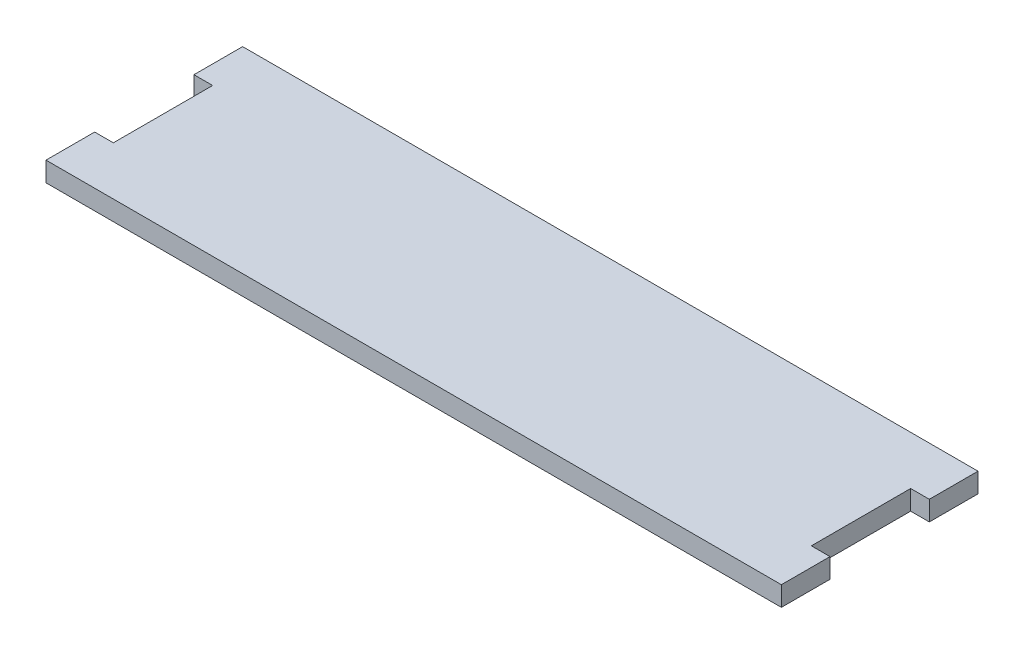
ISO-10303-21;
HEADER;
FILE_DESCRIPTION(('STEP AP214'),'2;1');
FILE_NAME('part.step','',(''),(''),'','','');
FILE_SCHEMA(('AUTOMOTIVE_DESIGN { 1 0 10303 214 1 1 1 1 }'));
ENDSEC;
DATA;
#1=APPLICATION_CONTEXT('core data for automotive mechanical design processes');
#2=APPLICATION_PROTOCOL_DEFINITION('international standard','automotive_design',2000,#1);
#3=PRODUCT_CONTEXT('',#1,'mechanical');
#4=PRODUCT('Part','Part','',(#3));
#5=PRODUCT_RELATED_PRODUCT_CATEGORY('part','',(#4));
#6=PRODUCT_DEFINITION_FORMATION('','',#4);
#7=PRODUCT_DEFINITION_CONTEXT('part definition',#1,'design');
#8=PRODUCT_DEFINITION('design','',#6,#7);
#9=PRODUCT_DEFINITION_SHAPE('','',#8);
#10=(LENGTH_UNIT() NAMED_UNIT(*) SI_UNIT(.MILLI.,.METRE.));
#11=(NAMED_UNIT(*) PLANE_ANGLE_UNIT() SI_UNIT($,.RADIAN.));
#12=(NAMED_UNIT(*) SI_UNIT($,.STERADIAN.) SOLID_ANGLE_UNIT());
#13=UNCERTAINTY_MEASURE_WITH_UNIT(LENGTH_MEASURE(1.E-05),#10,'distance_accuracy_value','');
#14=(GEOMETRIC_REPRESENTATION_CONTEXT(3) GLOBAL_UNCERTAINTY_ASSIGNED_CONTEXT((#13)) GLOBAL_UNIT_ASSIGNED_CONTEXT((#10,
#11,#12)) REPRESENTATION_CONTEXT('',''));
#15=CARTESIAN_POINT('',(0.,0.,0.));
#16=DIRECTION('',(0.,0.,1.));
#17=DIRECTION('',(1.,0.,0.));
#18=AXIS2_PLACEMENT_3D('',#15,#16,#17);
#19=CARTESIAN_POINT('',(-90.17,5.08,-25.4));
#20=DIRECTION('',(0.,0.,1.));
#21=DIRECTION('',(1.,0.,0.));
#22=AXIS2_PLACEMENT_3D('',#19,#20,#21);
#23=PLANE('',#22);
#24=DIRECTION('',(-1.,0.,0.));
#25=VECTOR('',#24,1.);
#26=CARTESIAN_POINT('',(-90.17,0.,-25.4));
#27=LINE('',#26,#25);
#28=CARTESIAN_POINT('',(94.996,0.,-25.4));
#29=VERTEX_POINT('',#28);
#30=CARTESIAN_POINT('',(-94.996,0.,-25.4));
#31=VERTEX_POINT('',#30);
#32=EDGE_CURVE('E97',#29,#31,#27,.T.);
#33=ORIENTED_EDGE('',*,*,#32,.T.);
#34=DIRECTION('',(0.,-1.,0.));
#35=VECTOR('',#34,1.);
#36=CARTESIAN_POINT('',(-94.996,5.08,-25.4));
#37=LINE('',#36,#35);
#38=CARTESIAN_POINT('',(-94.996,5.08,-25.4));
#39=VERTEX_POINT('',#38);
#40=EDGE_CURVE('E11',#39,#31,#37,.T.);
#41=ORIENTED_EDGE('',*,*,#40,.F.);
#42=DIRECTION('',(-1.,0.,0.));
#43=VECTOR('',#42,1.);
#44=CARTESIAN_POINT('',(90.17,5.08,-25.4));
#45=LINE('',#44,#43);
#46=CARTESIAN_POINT('',(94.996,5.08,-25.4));
#47=VERTEX_POINT('',#46);
#48=EDGE_CURVE('E103',#47,#39,#45,.T.);
#49=ORIENTED_EDGE('',*,*,#48,.F.);
#50=DIRECTION('',(0.,-1.,0.));
#51=VECTOR('',#50,1.);
#52=CARTESIAN_POINT('',(94.996,5.08,-25.4));
#53=LINE('',#52,#51);
#54=EDGE_CURVE('E149',#47,#29,#53,.T.);
#55=ORIENTED_EDGE('',*,*,#54,.T.);
#56=EDGE_LOOP('',(#33,#41,#49,#55));
#57=FACE_BOUND('',#56,.T.);
#58=ADVANCED_FACE('F33',(#57),#23,.F.);
#59=CARTESIAN_POINT('',(-94.996,5.08,-25.4));
#60=DIRECTION('',(1.,0.,0.));
#61=DIRECTION('',(0.,0.,-1.));
#62=AXIS2_PLACEMENT_3D('',#59,#60,#61);
#63=PLANE('',#62);
#64=DIRECTION('',(0.,0.,1.));
#65=VECTOR('',#64,1.);
#66=CARTESIAN_POINT('',(-94.996,0.,-25.4));
#67=LINE('',#66,#65);
#68=CARTESIAN_POINT('',(-94.996,0.,-12.827));
#69=VERTEX_POINT('',#68);
#70=EDGE_CURVE('E154',#31,#69,#67,.T.);
#71=ORIENTED_EDGE('',*,*,#70,.T.);
#72=DIRECTION('',(0.,-1.,0.));
#73=VECTOR('',#72,1.);
#74=CARTESIAN_POINT('',(-94.996,5.08,-12.827));
#75=LINE('',#74,#73);
#76=CARTESIAN_POINT('',(-94.996,5.08,-12.827));
#77=VERTEX_POINT('',#76);
#78=EDGE_CURVE('E41',#77,#69,#75,.T.);
#79=ORIENTED_EDGE('',*,*,#78,.F.);
#80=DIRECTION('',(0.,0.,1.));
#81=VECTOR('',#80,1.);
#82=CARTESIAN_POINT('',(-94.996,5.08,-25.4));
#83=LINE('',#82,#81);
#84=EDGE_CURVE('E243',#39,#77,#83,.T.);
#85=ORIENTED_EDGE('',*,*,#84,.F.);
#86=ORIENTED_EDGE('',*,*,#40,.T.);
#87=EDGE_LOOP('',(#71,#79,#85,#86));
#88=FACE_BOUND('',#87,.T.);
#89=ADVANCED_FACE('F246',(#88),#63,.F.);
#90=CARTESIAN_POINT('',(-90.17,5.08,-12.827));
#91=DIRECTION('',(0.,0.,-1.));
#92=DIRECTION('',(-1.,0.,0.));
#93=AXIS2_PLACEMENT_3D('',#90,#91,#92);
#94=PLANE('',#93);
#95=DIRECTION('',(1.,0.,0.));
#96=VECTOR('',#95,1.);
#97=CARTESIAN_POINT('',(-90.17,0.,-12.827));
#98=LINE('',#97,#96);
#99=CARTESIAN_POINT('',(-90.17,0.,-12.827));
#100=VERTEX_POINT('',#99);
#101=EDGE_CURVE('E156',#69,#100,#98,.T.);
#102=ORIENTED_EDGE('',*,*,#101,.T.);
#103=DIRECTION('',(0.,-1.,0.));
#104=VECTOR('',#103,1.);
#105=CARTESIAN_POINT('',(-90.17,5.08,-12.827));
#106=LINE('',#105,#104);
#107=CARTESIAN_POINT('',(-90.17,5.08,-12.827));
#108=VERTEX_POINT('',#107);
#109=EDGE_CURVE('E194',#108,#100,#106,.T.);
#110=ORIENTED_EDGE('',*,*,#109,.F.);
#111=DIRECTION('',(1.,0.,0.));
#112=VECTOR('',#111,1.);
#113=CARTESIAN_POINT('',(-90.17,5.08,-12.827));
#114=LINE('',#113,#112);
#115=EDGE_CURVE('E203',#77,#108,#114,.T.);
#116=ORIENTED_EDGE('',*,*,#115,.F.);
#117=ORIENTED_EDGE('',*,*,#78,.T.);
#118=EDGE_LOOP('',(#102,#110,#116,#117));
#119=FACE_BOUND('',#118,.T.);
#120=ADVANCED_FACE('F201',(#119),#94,.F.);
#121=CARTESIAN_POINT('',(-90.17,5.08,12.827));
#122=DIRECTION('',(1.,0.,0.));
#123=DIRECTION('',(0.,0.,-1.));
#124=AXIS2_PLACEMENT_3D('',#121,#122,#123);
#125=PLANE('',#124);
#126=DIRECTION('',(0.,0.,1.));
#127=VECTOR('',#126,1.);
#128=CARTESIAN_POINT('',(-90.17,0.,12.827));
#129=LINE('',#128,#127);
#130=CARTESIAN_POINT('',(-90.17,0.,12.827));
#131=VERTEX_POINT('',#130);
#132=EDGE_CURVE('E158',#100,#131,#129,.T.);
#133=ORIENTED_EDGE('',*,*,#132,.T.);
#134=DIRECTION('',(0.,-1.,0.));
#135=VECTOR('',#134,1.);
#136=CARTESIAN_POINT('',(-90.17,5.08,12.827));
#137=LINE('',#136,#135);
#138=CARTESIAN_POINT('',(-90.17,5.08,12.827));
#139=VERTEX_POINT('',#138);
#140=EDGE_CURVE('E191',#139,#131,#137,.T.);
#141=ORIENTED_EDGE('',*,*,#140,.F.);
#142=DIRECTION('',(0.,0.,1.));
#143=VECTOR('',#142,1.);
#144=CARTESIAN_POINT('',(-90.17,5.08,12.827));
#145=LINE('',#144,#143);
#146=EDGE_CURVE('E221',#108,#139,#145,.T.);
#147=ORIENTED_EDGE('',*,*,#146,.F.);
#148=ORIENTED_EDGE('',*,*,#109,.T.);
#149=EDGE_LOOP('',(#133,#141,#147,#148));
#150=FACE_BOUND('',#149,.T.);
#151=ADVANCED_FACE('F212',(#150),#125,.F.);
#152=CARTESIAN_POINT('',(-90.17,5.08,12.827));
#153=DIRECTION('',(0.,0.,1.));
#154=DIRECTION('',(1.,0.,0.));
#155=AXIS2_PLACEMENT_3D('',#152,#153,#154);
#156=PLANE('',#155);
#157=DIRECTION('',(-1.,0.,0.));
#158=VECTOR('',#157,1.);
#159=CARTESIAN_POINT('',(-90.17,0.,12.827));
#160=LINE('',#159,#158);
#161=CARTESIAN_POINT('',(-94.996,0.,12.827));
#162=VERTEX_POINT('',#161);
#163=EDGE_CURVE('E160',#131,#162,#160,.T.);
#164=ORIENTED_EDGE('',*,*,#163,.T.);
#165=DIRECTION('',(0.,-1.,0.));
#166=VECTOR('',#165,1.);
#167=CARTESIAN_POINT('',(-94.996,5.08,12.827));
#168=LINE('',#167,#166);
#169=CARTESIAN_POINT('',(-94.996,5.08,12.827));
#170=VERTEX_POINT('',#169);
#171=EDGE_CURVE('E188',#170,#162,#168,.T.);
#172=ORIENTED_EDGE('',*,*,#171,.F.);
#173=DIRECTION('',(-1.,0.,0.));
#174=VECTOR('',#173,1.);
#175=CARTESIAN_POINT('',(-90.17,5.08,12.827));
#176=LINE('',#175,#174);
#177=EDGE_CURVE('E218',#139,#170,#176,.T.);
#178=ORIENTED_EDGE('',*,*,#177,.F.);
#179=ORIENTED_EDGE('',*,*,#140,.T.);
#180=EDGE_LOOP('',(#164,#172,#178,#179));
#181=FACE_BOUND('',#180,.T.);
#182=ADVANCED_FACE('F216',(#181),#156,.F.);
#183=CARTESIAN_POINT('',(-94.996,5.08,25.4));
#184=DIRECTION('',(1.,0.,0.));
#185=DIRECTION('',(0.,0.,-1.));
#186=AXIS2_PLACEMENT_3D('',#183,#184,#185);
#187=PLANE('',#186);
#188=DIRECTION('',(0.,0.,1.));
#189=VECTOR('',#188,1.);
#190=CARTESIAN_POINT('',(-94.996,0.,25.4));
#191=LINE('',#190,#189);
#192=CARTESIAN_POINT('',(-94.996,0.,25.4));
#193=VERTEX_POINT('',#192);
#194=EDGE_CURVE('E162',#162,#193,#191,.T.);
#195=ORIENTED_EDGE('',*,*,#194,.T.);
#196=DIRECTION('',(0.,-1.,0.));
#197=VECTOR('',#196,1.);
#198=CARTESIAN_POINT('',(-94.996,5.08,25.4));
#199=LINE('',#198,#197);
#200=CARTESIAN_POINT('',(-94.996,5.08,25.4));
#201=VERTEX_POINT('',#200);
#202=EDGE_CURVE('E185',#201,#193,#199,.T.);
#203=ORIENTED_EDGE('',*,*,#202,.F.);
#204=DIRECTION('',(0.,0.,1.));
#205=VECTOR('',#204,1.);
#206=CARTESIAN_POINT('',(-94.996,5.08,25.4));
#207=LINE('',#206,#205);
#208=EDGE_CURVE('E220',#170,#201,#207,.T.);
#209=ORIENTED_EDGE('',*,*,#208,.F.);
#210=ORIENTED_EDGE('',*,*,#171,.T.);
#211=EDGE_LOOP('',(#195,#203,#209,#210));
#212=FACE_BOUND('',#211,.T.);
#213=ADVANCED_FACE('F258',(#212),#187,.F.);
#214=CARTESIAN_POINT('',(90.17,5.08,25.4));
#215=DIRECTION('',(0.,0.,-1.));
#216=DIRECTION('',(-1.,0.,0.));
#217=AXIS2_PLACEMENT_3D('',#214,#215,#216);
#218=PLANE('',#217);
#219=DIRECTION('',(1.,0.,0.));
#220=VECTOR('',#219,1.);
#221=CARTESIAN_POINT('',(90.17,0.,25.4));
#222=LINE('',#221,#220);
#223=CARTESIAN_POINT('',(94.996,0.,25.4));
#224=VERTEX_POINT('',#223);
#225=EDGE_CURVE('E165',#193,#224,#222,.T.);
#226=ORIENTED_EDGE('',*,*,#225,.T.);
#227=DIRECTION('',(0.,-1.,0.));
#228=VECTOR('',#227,1.);
#229=CARTESIAN_POINT('',(94.996,5.08,25.4));
#230=LINE('',#229,#228);
#231=CARTESIAN_POINT('',(94.996,5.08,25.4));
#232=VERTEX_POINT('',#231);
#233=EDGE_CURVE('E182',#232,#224,#230,.T.);
#234=ORIENTED_EDGE('',*,*,#233,.F.);
#235=DIRECTION('',(1.,0.,0.));
#236=VECTOR('',#235,1.);
#237=CARTESIAN_POINT('',(-90.17,5.08,25.4));
#238=LINE('',#237,#236);
#239=EDGE_CURVE('E223',#201,#232,#238,.T.);
#240=ORIENTED_EDGE('',*,*,#239,.F.);
#241=ORIENTED_EDGE('',*,*,#202,.T.);
#242=EDGE_LOOP('',(#226,#234,#240,#241));
#243=FACE_BOUND('',#242,.T.);
#244=ADVANCED_FACE('F261',(#243),#218,.F.);
#245=CARTESIAN_POINT('',(94.996,5.08,25.4));
#246=DIRECTION('',(-1.,0.,0.));
#247=DIRECTION('',(0.,0.,1.));
#248=AXIS2_PLACEMENT_3D('',#245,#246,#247);
#249=PLANE('',#248);
#250=DIRECTION('',(0.,0.,-1.));
#251=VECTOR('',#250,1.);
#252=CARTESIAN_POINT('',(94.996,0.,25.4));
#253=LINE('',#252,#251);
#254=CARTESIAN_POINT('',(94.996,0.,12.827));
#255=VERTEX_POINT('',#254);
#256=EDGE_CURVE('E167',#224,#255,#253,.T.);
#257=ORIENTED_EDGE('',*,*,#256,.T.);
#258=DIRECTION('',(0.,-1.,0.));
#259=VECTOR('',#258,1.);
#260=CARTESIAN_POINT('',(94.996,5.08,12.827));
#261=LINE('',#260,#259);
#262=CARTESIAN_POINT('',(94.996,5.08,12.827));
#263=VERTEX_POINT('',#262);
#264=EDGE_CURVE('E179',#263,#255,#261,.T.);
#265=ORIENTED_EDGE('',*,*,#264,.F.);
#266=DIRECTION('',(0.,0.,-1.));
#267=VECTOR('',#266,1.);
#268=CARTESIAN_POINT('',(94.996,5.08,25.4));
#269=LINE('',#268,#267);
#270=EDGE_CURVE('E229',#232,#263,#269,.T.);
#271=ORIENTED_EDGE('',*,*,#270,.F.);
#272=ORIENTED_EDGE('',*,*,#233,.T.);
#273=EDGE_LOOP('',(#257,#265,#271,#272));
#274=FACE_BOUND('',#273,.T.);
#275=ADVANCED_FACE('F235',(#274),#249,.F.);
#276=CARTESIAN_POINT('',(90.17,5.08,12.827));
#277=DIRECTION('',(0.,0.,1.));
#278=DIRECTION('',(1.,0.,0.));
#279=AXIS2_PLACEMENT_3D('',#276,#277,#278);
#280=PLANE('',#279);
#281=DIRECTION('',(-1.,0.,0.));
#282=VECTOR('',#281,1.);
#283=CARTESIAN_POINT('',(90.17,0.,12.827));
#284=LINE('',#283,#282);
#285=CARTESIAN_POINT('',(90.17,0.,12.827));
#286=VERTEX_POINT('',#285);
#287=EDGE_CURVE('E169',#255,#286,#284,.T.);
#288=ORIENTED_EDGE('',*,*,#287,.T.);
#289=DIRECTION('',(0.,-1.,0.));
#290=VECTOR('',#289,1.);
#291=CARTESIAN_POINT('',(90.17,5.08,12.827));
#292=LINE('',#291,#290);
#293=CARTESIAN_POINT('',(90.17,5.08,12.827));
#294=VERTEX_POINT('',#293);
#295=EDGE_CURVE('E144',#294,#286,#292,.T.);
#296=ORIENTED_EDGE('',*,*,#295,.F.);
#297=DIRECTION('',(-1.,0.,0.));
#298=VECTOR('',#297,1.);
#299=CARTESIAN_POINT('',(90.17,5.08,12.827));
#300=LINE('',#299,#298);
#301=EDGE_CURVE('E135',#263,#294,#300,.T.);
#302=ORIENTED_EDGE('',*,*,#301,.F.);
#303=ORIENTED_EDGE('',*,*,#264,.T.);
#304=EDGE_LOOP('',(#288,#296,#302,#303));
#305=FACE_BOUND('',#304,.T.);
#306=ADVANCED_FACE('F239',(#305),#280,.F.);
#307=CARTESIAN_POINT('',(90.17,5.08,12.827));
#308=DIRECTION('',(-1.,0.,0.));
#309=DIRECTION('',(0.,0.,1.));
#310=AXIS2_PLACEMENT_3D('',#307,#308,#309);
#311=PLANE('',#310);
#312=DIRECTION('',(0.,0.,-1.));
#313=VECTOR('',#312,1.);
#314=CARTESIAN_POINT('',(90.17,0.,12.827));
#315=LINE('',#314,#313);
#316=CARTESIAN_POINT('',(90.17,0.,-12.827));
#317=VERTEX_POINT('',#316);
#318=EDGE_CURVE('E143',#286,#317,#315,.T.);
#319=ORIENTED_EDGE('',*,*,#318,.T.);
#320=DIRECTION('',(0.,-1.,0.));
#321=VECTOR('',#320,1.);
#322=CARTESIAN_POINT('',(90.17,5.08,-12.827));
#323=LINE('',#322,#321);
#324=CARTESIAN_POINT('',(90.17,5.08,-12.827));
#325=VERTEX_POINT('',#324);
#326=EDGE_CURVE('E140',#325,#317,#323,.T.);
#327=ORIENTED_EDGE('',*,*,#326,.F.);
#328=DIRECTION('',(0.,0.,-1.));
#329=VECTOR('',#328,1.);
#330=CARTESIAN_POINT('',(90.17,5.08,12.827));
#331=LINE('',#330,#329);
#332=EDGE_CURVE('E129',#294,#325,#331,.T.);
#333=ORIENTED_EDGE('',*,*,#332,.F.);
#334=ORIENTED_EDGE('',*,*,#295,.T.);
#335=EDGE_LOOP('',(#319,#327,#333,#334));
#336=FACE_BOUND('',#335,.T.);
#337=ADVANCED_FACE('F141',(#336),#311,.F.);
#338=CARTESIAN_POINT('',(90.17,5.08,-12.827));
#339=DIRECTION('',(0.,0.,-1.));
#340=DIRECTION('',(-1.,0.,0.));
#341=AXIS2_PLACEMENT_3D('',#338,#339,#340);
#342=PLANE('',#341);
#343=DIRECTION('',(1.,0.,0.));
#344=VECTOR('',#343,1.);
#345=CARTESIAN_POINT('',(90.17,0.,-12.827));
#346=LINE('',#345,#344);
#347=CARTESIAN_POINT('',(94.996,0.,-12.827));
#348=VERTEX_POINT('',#347);
#349=EDGE_CURVE('E90',#317,#348,#346,.T.);
#350=ORIENTED_EDGE('',*,*,#349,.T.);
#351=DIRECTION('',(0.,-1.,0.));
#352=VECTOR('',#351,1.);
#353=CARTESIAN_POINT('',(94.996,5.08,-12.827));
#354=LINE('',#353,#352);
#355=CARTESIAN_POINT('',(94.996,5.08,-12.827));
#356=VERTEX_POINT('',#355);
#357=EDGE_CURVE('E145',#356,#348,#354,.T.);
#358=ORIENTED_EDGE('',*,*,#357,.F.);
#359=DIRECTION('',(1.,0.,0.));
#360=VECTOR('',#359,1.);
#361=CARTESIAN_POINT('',(90.17,5.08,-12.827));
#362=LINE('',#361,#360);
#363=EDGE_CURVE('E133',#325,#356,#362,.T.);
#364=ORIENTED_EDGE('',*,*,#363,.F.);
#365=ORIENTED_EDGE('',*,*,#326,.T.);
#366=EDGE_LOOP('',(#350,#358,#364,#365));
#367=FACE_BOUND('',#366,.T.);
#368=ADVANCED_FACE('F147',(#367),#342,.F.);
#369=CARTESIAN_POINT('',(94.996,5.08,-25.4));
#370=DIRECTION('',(-1.,0.,0.));
#371=DIRECTION('',(0.,0.,1.));
#372=AXIS2_PLACEMENT_3D('',#369,#370,#371);
#373=PLANE('',#372);
#374=DIRECTION('',(0.,0.,-1.));
#375=VECTOR('',#374,1.);
#376=CARTESIAN_POINT('',(94.996,0.,-25.4));
#377=LINE('',#376,#375);
#378=EDGE_CURVE('E173',#348,#29,#377,.T.);
#379=ORIENTED_EDGE('',*,*,#378,.T.);
#380=ORIENTED_EDGE('',*,*,#54,.F.);
#381=DIRECTION('',(0.,0.,-1.));
#382=VECTOR('',#381,1.);
#383=CARTESIAN_POINT('',(94.996,5.08,-25.4));
#384=LINE('',#383,#382);
#385=EDGE_CURVE('E49',#356,#47,#384,.T.);
#386=ORIENTED_EDGE('',*,*,#385,.F.);
#387=ORIENTED_EDGE('',*,*,#357,.T.);
#388=EDGE_LOOP('',(#379,#380,#386,#387));
#389=FACE_BOUND('',#388,.T.);
#390=ADVANCED_FACE('F241',(#389),#373,.F.);
#391=CARTESIAN_POINT('',(0.,5.08,0.));
#392=DIRECTION('',(0.,-1.,0.));
#393=DIRECTION('',(0.,0.,-1.));
#394=AXIS2_PLACEMENT_3D('',#391,#392,#393);
#395=PLANE('',#394);
#396=ORIENTED_EDGE('',*,*,#48,.T.);
#397=ORIENTED_EDGE('',*,*,#84,.T.);
#398=ORIENTED_EDGE('',*,*,#115,.T.);
#399=ORIENTED_EDGE('',*,*,#146,.T.);
#400=ORIENTED_EDGE('',*,*,#177,.T.);
#401=ORIENTED_EDGE('',*,*,#208,.T.);
#402=ORIENTED_EDGE('',*,*,#239,.T.);
#403=ORIENTED_EDGE('',*,*,#270,.T.);
#404=ORIENTED_EDGE('',*,*,#301,.T.);
#405=ORIENTED_EDGE('',*,*,#332,.T.);
#406=ORIENTED_EDGE('',*,*,#363,.T.);
#407=ORIENTED_EDGE('',*,*,#385,.T.);
#408=EDGE_LOOP('',(#396,#397,#398,#399,#400,#401,#402,#403,#404,#405,#406,#407));
#409=FACE_BOUND('',#408,.T.);
#410=ADVANCED_FACE('F131',(#409),#395,.F.);
#411=CARTESIAN_POINT('',(0.,0.,0.));
#412=DIRECTION('',(0.,-1.,0.));
#413=DIRECTION('',(0.,0.,-1.));
#414=AXIS2_PLACEMENT_3D('',#411,#412,#413);
#415=PLANE('',#414);
#416=ORIENTED_EDGE('',*,*,#32,.F.);
#417=ORIENTED_EDGE('',*,*,#378,.F.);
#418=ORIENTED_EDGE('',*,*,#349,.F.);
#419=ORIENTED_EDGE('',*,*,#318,.F.);
#420=ORIENTED_EDGE('',*,*,#287,.F.);
#421=ORIENTED_EDGE('',*,*,#256,.F.);
#422=ORIENTED_EDGE('',*,*,#225,.F.);
#423=ORIENTED_EDGE('',*,*,#194,.F.);
#424=ORIENTED_EDGE('',*,*,#163,.F.);
#425=ORIENTED_EDGE('',*,*,#132,.F.);
#426=ORIENTED_EDGE('',*,*,#101,.F.);
#427=ORIENTED_EDGE('',*,*,#70,.F.);
#428=EDGE_LOOP('',(#416,#417,#418,#419,#420,#421,#422,#423,#424,#425,#426,#427));
#429=FACE_BOUND('',#428,.T.);
#430=ADVANCED_FACE('F207',(#429),#415,.T.);
#431=CLOSED_SHELL('',(#58,#89,#120,#151,#182,#213,#244,#275,#306,#337,#368,#390,#410,#430));
#432=MANIFOLD_SOLID_BREP('B2',#431);
#433=ADVANCED_BREP_SHAPE_REPRESENTATION('',(#18,#432),#14);
#434=SHAPE_DEFINITION_REPRESENTATION(#9,#433);
ENDSEC;
END-ISO-10303-21;
